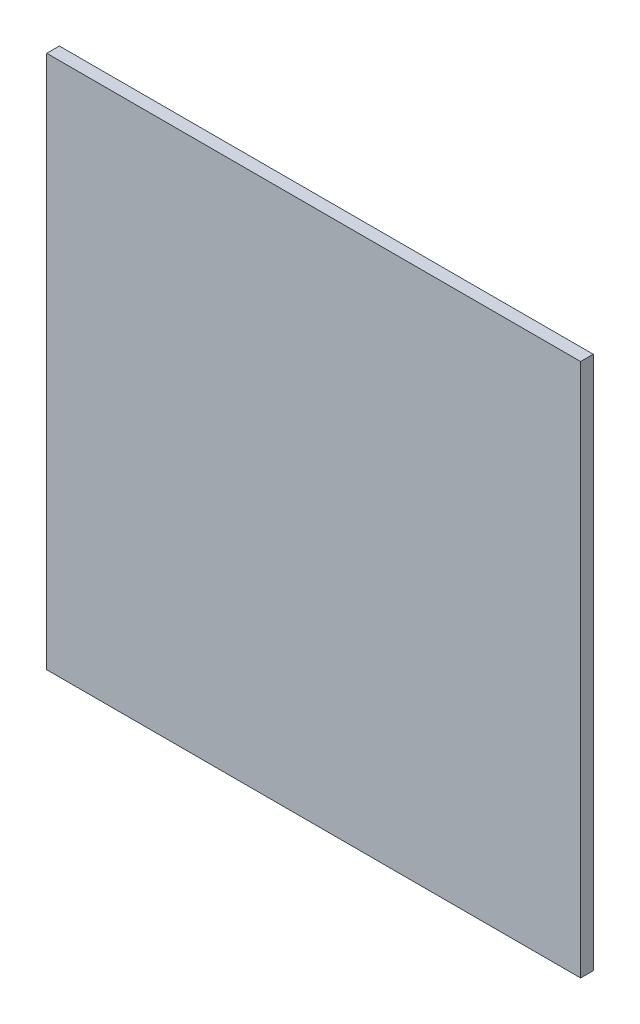
ISO-10303-21;
HEADER;
FILE_DESCRIPTION(('STEP AP214'),'2;1');
FILE_NAME('part.step','',(''),(''),'','','');
FILE_SCHEMA(('AUTOMOTIVE_DESIGN { 1 0 10303 214 1 1 1 1 }'));
ENDSEC;
DATA;
#1=APPLICATION_CONTEXT('core data for automotive mechanical design processes');
#2=APPLICATION_PROTOCOL_DEFINITION('international standard','automotive_design',2000,#1);
#3=PRODUCT_CONTEXT('',#1,'mechanical');
#4=PRODUCT('Part','Part','',(#3));
#5=PRODUCT_RELATED_PRODUCT_CATEGORY('part','',(#4));
#6=PRODUCT_DEFINITION_FORMATION('','',#4);
#7=PRODUCT_DEFINITION_CONTEXT('part definition',#1,'design');
#8=PRODUCT_DEFINITION('design','',#6,#7);
#9=PRODUCT_DEFINITION_SHAPE('','',#8);
#10=(LENGTH_UNIT() NAMED_UNIT(*) SI_UNIT(.MILLI.,.METRE.));
#11=(NAMED_UNIT(*) PLANE_ANGLE_UNIT() SI_UNIT($,.RADIAN.));
#12=(NAMED_UNIT(*) SI_UNIT($,.STERADIAN.) SOLID_ANGLE_UNIT());
#13=UNCERTAINTY_MEASURE_WITH_UNIT(LENGTH_MEASURE(1.E-05),#10,'distance_accuracy_value','');
#14=(GEOMETRIC_REPRESENTATION_CONTEXT(3) GLOBAL_UNCERTAINTY_ASSIGNED_CONTEXT((#13)) GLOBAL_UNIT_ASSIGNED_CONTEXT((#10,
#11,#12)) REPRESENTATION_CONTEXT('',''));
#15=CARTESIAN_POINT('',(0.,0.,0.));
#16=DIRECTION('',(0.,0.,1.));
#17=DIRECTION('',(1.,0.,0.));
#18=AXIS2_PLACEMENT_3D('',#15,#16,#17);
#19=CARTESIAN_POINT('',(6.60008,3.625,0.));
#20=DIRECTION('',(0.,0.,-1.));
#21=DIRECTION('',(-1.,0.,0.));
#22=AXIS2_PLACEMENT_3D('',#19,#20,#21);
#23=PLANE('',#22);
#24=DIRECTION('',(1.,0.,0.));
#25=VECTOR('',#24,1.);
#26=CARTESIAN_POINT('',(5.87508,4.35,0.));
#27=LINE('',#26,#25);
#28=CARTESIAN_POINT('',(5.87508,4.35,0.));
#29=VERTEX_POINT('',#28);
#30=CARTESIAN_POINT('',(7.32508,4.35,0.));
#31=VERTEX_POINT('',#30);
#32=EDGE_CURVE('E55',#29,#31,#27,.T.);
#33=ORIENTED_EDGE('',*,*,#32,.T.);
#34=DIRECTION('',(0.,1.,0.));
#35=VECTOR('',#34,1.);
#36=CARTESIAN_POINT('',(7.32508,4.35,0.));
#37=LINE('',#36,#35);
#38=CARTESIAN_POINT('',(7.32508,2.9,0.));
#39=VERTEX_POINT('',#38);
#40=EDGE_CURVE('E57',#31,#39,#37,.F.);
#41=ORIENTED_EDGE('',*,*,#40,.T.);
#42=DIRECTION('',(1.,0.,0.));
#43=VECTOR('',#42,1.);
#44=CARTESIAN_POINT('',(7.32508,2.9,0.));
#45=LINE('',#44,#43);
#46=CARTESIAN_POINT('',(5.87508,2.9,0.));
#47=VERTEX_POINT('',#46);
#48=EDGE_CURVE('E20',#39,#47,#45,.F.);
#49=ORIENTED_EDGE('',*,*,#48,.T.);
#50=DIRECTION('',(0.,1.,0.));
#51=VECTOR('',#50,1.);
#52=CARTESIAN_POINT('',(5.87508,2.9,0.));
#53=LINE('',#52,#51);
#54=EDGE_CURVE('E80',#47,#29,#53,.T.);
#55=ORIENTED_EDGE('',*,*,#54,.T.);
#56=EDGE_LOOP('',(#33,#41,#49,#55));
#57=FACE_BOUND('',#56,.T.);
#58=ADVANCED_FACE('F17',(#57),#23,.T.);
#59=CARTESIAN_POINT('',(7.32508,2.9,0.));
#60=DIRECTION('',(0.,1.,0.));
#61=DIRECTION('',(0.,0.,1.));
#62=AXIS2_PLACEMENT_3D('',#59,#60,#61);
#63=PLANE('',#62);
#64=DIRECTION('',(0.,0.,-1.));
#65=VECTOR('',#64,1.);
#66=CARTESIAN_POINT('',(5.87508,2.9,0.));
#67=LINE('',#66,#65);
#68=CARTESIAN_POINT('',(5.87508,2.9,0.03429));
#69=VERTEX_POINT('',#68);
#70=EDGE_CURVE('E68',#69,#47,#67,.T.);
#71=ORIENTED_EDGE('',*,*,#70,.T.);
#72=ORIENTED_EDGE('',*,*,#48,.F.);
#73=DIRECTION('',(0.,0.,1.));
#74=VECTOR('',#73,1.);
#75=CARTESIAN_POINT('',(7.32508,2.9,0.));
#76=LINE('',#75,#74);
#77=CARTESIAN_POINT('',(7.32508,2.9,0.03429));
#78=VERTEX_POINT('',#77);
#79=EDGE_CURVE('E63',#39,#78,#76,.T.);
#80=ORIENTED_EDGE('',*,*,#79,.T.);
#81=DIRECTION('',(1.,0.,0.));
#82=VECTOR('',#81,1.);
#83=CARTESIAN_POINT('',(6.60008,2.9,0.03429));
#84=LINE('',#83,#82);
#85=EDGE_CURVE('E83',#69,#78,#84,.T.);
#86=ORIENTED_EDGE('',*,*,#85,.F.);
#87=EDGE_LOOP('',(#71,#72,#80,#86));
#88=FACE_BOUND('',#87,.T.);
#89=ADVANCED_FACE('F65',(#88),#63,.F.);
#90=CARTESIAN_POINT('',(7.32508,4.35,0.));
#91=DIRECTION('',(-1.,0.,0.));
#92=DIRECTION('',(0.,0.,1.));
#93=AXIS2_PLACEMENT_3D('',#90,#91,#92);
#94=PLANE('',#93);
#95=ORIENTED_EDGE('',*,*,#79,.F.);
#96=ORIENTED_EDGE('',*,*,#40,.F.);
#97=DIRECTION('',(0.,0.,-1.));
#98=VECTOR('',#97,1.);
#99=CARTESIAN_POINT('',(7.32508,4.35,0.));
#100=LINE('',#99,#98);
#101=CARTESIAN_POINT('',(7.32508,4.35,0.03429));
#102=VERTEX_POINT('',#101);
#103=EDGE_CURVE('E75',#31,#102,#100,.F.);
#104=ORIENTED_EDGE('',*,*,#103,.T.);
#105=DIRECTION('',(0.,1.,0.));
#106=VECTOR('',#105,1.);
#107=CARTESIAN_POINT('',(7.32508,3.625,0.03429));
#108=LINE('',#107,#106);
#109=EDGE_CURVE('E72',#78,#102,#108,.T.);
#110=ORIENTED_EDGE('',*,*,#109,.F.);
#111=EDGE_LOOP('',(#95,#96,#104,#110));
#112=FACE_BOUND('',#111,.T.);
#113=ADVANCED_FACE('F70',(#112),#94,.F.);
#114=CARTESIAN_POINT('',(5.87508,4.35,0.));
#115=DIRECTION('',(0.,-1.,0.));
#116=DIRECTION('',(0.,0.,-1.));
#117=AXIS2_PLACEMENT_3D('',#114,#115,#116);
#118=PLANE('',#117);
#119=ORIENTED_EDGE('',*,*,#103,.F.);
#120=ORIENTED_EDGE('',*,*,#32,.F.);
#121=DIRECTION('',(0.,0.,-1.));
#122=VECTOR('',#121,1.);
#123=CARTESIAN_POINT('',(5.87508,4.35,0.));
#124=LINE('',#123,#122);
#125=CARTESIAN_POINT('',(5.87508,4.35,0.03429));
#126=VERTEX_POINT('',#125);
#127=EDGE_CURVE('E35',#29,#126,#124,.F.);
#128=ORIENTED_EDGE('',*,*,#127,.T.);
#129=DIRECTION('',(1.,0.,0.));
#130=VECTOR('',#129,1.);
#131=CARTESIAN_POINT('',(6.60008,4.35,0.03429));
#132=LINE('',#131,#130);
#133=EDGE_CURVE('E26',#102,#126,#132,.F.);
#134=ORIENTED_EDGE('',*,*,#133,.F.);
#135=EDGE_LOOP('',(#119,#120,#128,#134));
#136=FACE_BOUND('',#135,.T.);
#137=ADVANCED_FACE('F89',(#136),#118,.F.);
#138=CARTESIAN_POINT('',(5.87508,2.9,0.));
#139=DIRECTION('',(1.,0.,0.));
#140=DIRECTION('',(0.,0.,-1.));
#141=AXIS2_PLACEMENT_3D('',#138,#139,#140);
#142=PLANE('',#141);
#143=ORIENTED_EDGE('',*,*,#127,.F.);
#144=ORIENTED_EDGE('',*,*,#54,.F.);
#145=ORIENTED_EDGE('',*,*,#70,.F.);
#146=DIRECTION('',(0.,1.,0.));
#147=VECTOR('',#146,1.);
#148=CARTESIAN_POINT('',(5.87508,3.625,0.03429));
#149=LINE('',#148,#147);
#150=EDGE_CURVE('E11',#126,#69,#149,.F.);
#151=ORIENTED_EDGE('',*,*,#150,.F.);
#152=EDGE_LOOP('',(#143,#144,#145,#151));
#153=FACE_BOUND('',#152,.T.);
#154=ADVANCED_FACE('F91',(#153),#142,.F.);
#155=CARTESIAN_POINT('',(6.60008,3.625,0.03429));
#156=DIRECTION('',(0.,0.,1.));
#157=DIRECTION('',(1.,0.,0.));
#158=AXIS2_PLACEMENT_3D('',#155,#156,#157);
#159=PLANE('',#158);
#160=ORIENTED_EDGE('',*,*,#133,.T.);
#161=ORIENTED_EDGE('',*,*,#150,.T.);
#162=ORIENTED_EDGE('',*,*,#85,.T.);
#163=ORIENTED_EDGE('',*,*,#109,.T.);
#164=EDGE_LOOP('',(#160,#161,#162,#163));
#165=FACE_BOUND('',#164,.T.);
#166=ADVANCED_FACE('F88',(#165),#159,.T.);
#167=CLOSED_SHELL('',(#58,#89,#113,#137,#154,#166));
#168=MANIFOLD_SOLID_BREP('B1',#167);
#169=ADVANCED_BREP_SHAPE_REPRESENTATION('',(#18,#168),#14);
#170=SHAPE_DEFINITION_REPRESENTATION(#9,#169);
ENDSEC;
END-ISO-10303-21;
